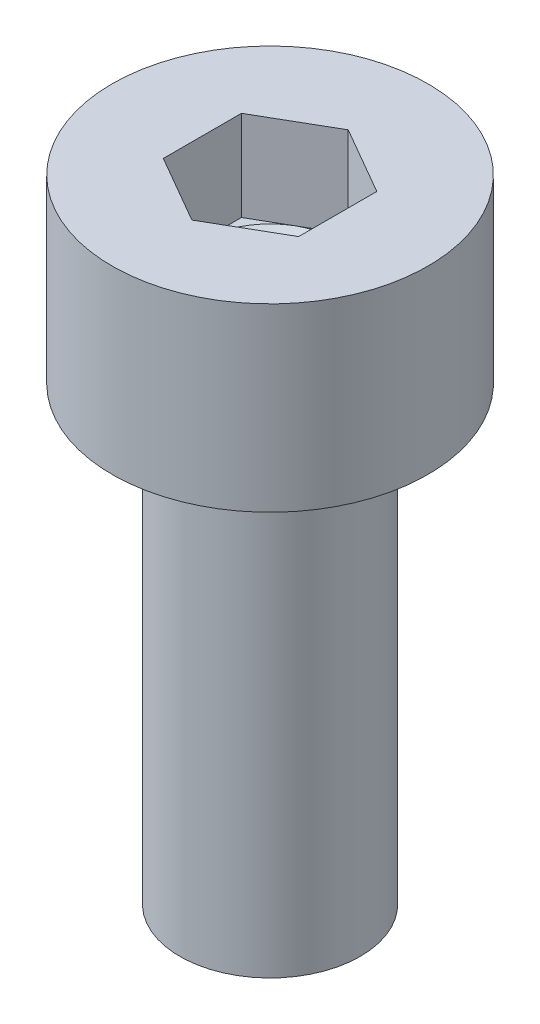
ISO-10303-21;
HEADER;
FILE_DESCRIPTION(('STEP AP214'),'2;1');
FILE_NAME('part.step','',(''),(''),'','','');
FILE_SCHEMA(('AUTOMOTIVE_DESIGN { 1 0 10303 214 1 1 1 1 }'));
ENDSEC;
DATA;
#1=APPLICATION_CONTEXT('core data for automotive mechanical design processes');
#2=APPLICATION_PROTOCOL_DEFINITION('international standard','automotive_design',2000,#1);
#3=PRODUCT_CONTEXT('',#1,'mechanical');
#4=PRODUCT('Part','Part','',(#3));
#5=PRODUCT_RELATED_PRODUCT_CATEGORY('part','',(#4));
#6=PRODUCT_DEFINITION_FORMATION('','',#4);
#7=PRODUCT_DEFINITION_CONTEXT('part definition',#1,'design');
#8=PRODUCT_DEFINITION('design','',#6,#7);
#9=PRODUCT_DEFINITION_SHAPE('','',#8);
#10=(LENGTH_UNIT() NAMED_UNIT(*) SI_UNIT(.MILLI.,.METRE.));
#11=(NAMED_UNIT(*) PLANE_ANGLE_UNIT() SI_UNIT($,.RADIAN.));
#12=(NAMED_UNIT(*) SI_UNIT($,.STERADIAN.) SOLID_ANGLE_UNIT());
#13=UNCERTAINTY_MEASURE_WITH_UNIT(LENGTH_MEASURE(1.E-05),#10,'distance_accuracy_value','');
#14=(GEOMETRIC_REPRESENTATION_CONTEXT(3) GLOBAL_UNCERTAINTY_ASSIGNED_CONTEXT((#13)) GLOBAL_UNIT_ASSIGNED_CONTEXT((#10,
#11,#12)) REPRESENTATION_CONTEXT('',''));
#15=CARTESIAN_POINT('',(0.,0.,0.));
#16=DIRECTION('',(0.,0.,1.));
#17=DIRECTION('',(1.,0.,0.));
#18=AXIS2_PLACEMENT_3D('',#15,#16,#17);
#19=CARTESIAN_POINT('',(0.,0.,0.));
#20=DIRECTION('',(0.,-1.,0.));
#21=DIRECTION('',(1.,0.,0.));
#22=AXIS2_PLACEMENT_3D('',#19,#20,#21);
#23=PLANE('',#22);
#24=CARTESIAN_POINT('',(0.,0.,0.));
#25=DIRECTION('',(0.,1.,0.));
#26=DIRECTION('',(-1.,0.,0.));
#27=AXIS2_PLACEMENT_3D('',#24,#25,#26);
#28=CIRCLE('',#27,3.5);
#29=CARTESIAN_POINT('',(-3.5,0.,0.));
#30=VERTEX_POINT('',#29);
#31=EDGE_CURVE('E11',#30,#30,#28,.T.);
#32=ORIENTED_EDGE('',*,*,#31,.T.);
#33=EDGE_LOOP('',(#32));
#34=FACE_BOUND('',#33,.T.);
#35=DIRECTION('',(-0.866025403784439,0.,0.5));
#36=VECTOR('',#35,1.);
#37=CARTESIAN_POINT('',(0.,0.,-1.73205080756888));
#38=LINE('',#37,#36);
#39=CARTESIAN_POINT('',(0.,0.,-1.73205080756888));
#40=VERTEX_POINT('',#39);
#41=CARTESIAN_POINT('',(-1.5,0.,-0.866025403784439));
#42=VERTEX_POINT('',#41);
#43=EDGE_CURVE('E152',#40,#42,#38,.T.);
#44=ORIENTED_EDGE('',*,*,#43,.F.);
#45=DIRECTION('',(-0.866025403784439,0.,-0.5));
#46=VECTOR('',#45,1.);
#47=CARTESIAN_POINT('',(1.5,0.,-0.866025403784439));
#48=LINE('',#47,#46);
#49=CARTESIAN_POINT('',(1.5,0.,-0.866025403784439));
#50=VERTEX_POINT('',#49);
#51=EDGE_CURVE('E53',#50,#40,#48,.T.);
#52=ORIENTED_EDGE('',*,*,#51,.F.);
#53=DIRECTION('',(0.,0.,-1.));
#54=VECTOR('',#53,1.);
#55=CARTESIAN_POINT('',(1.5,0.,0.866025403784439));
#56=LINE('',#55,#54);
#57=CARTESIAN_POINT('',(1.5,0.,0.866025403784439));
#58=VERTEX_POINT('',#57);
#59=EDGE_CURVE('E123',#58,#50,#56,.T.);
#60=ORIENTED_EDGE('',*,*,#59,.F.);
#61=DIRECTION('',(0.866025403784439,0.,-0.5));
#62=VECTOR('',#61,1.);
#63=CARTESIAN_POINT('',(0.,0.,1.73205080756888));
#64=LINE('',#63,#62);
#65=CARTESIAN_POINT('',(0.,0.,1.73205080756888));
#66=VERTEX_POINT('',#65);
#67=EDGE_CURVE('E159',#66,#58,#64,.T.);
#68=ORIENTED_EDGE('',*,*,#67,.F.);
#69=DIRECTION('',(0.866025403784439,0.,0.5));
#70=VECTOR('',#69,1.);
#71=CARTESIAN_POINT('',(-1.5,0.,0.866025403784439));
#72=LINE('',#71,#70);
#73=CARTESIAN_POINT('',(-1.5,0.,0.866025403784439));
#74=VERTEX_POINT('',#73);
#75=EDGE_CURVE('E156',#74,#66,#72,.T.);
#76=ORIENTED_EDGE('',*,*,#75,.F.);
#77=DIRECTION('',(0.,0.,1.));
#78=VECTOR('',#77,1.);
#79=CARTESIAN_POINT('',(-1.5,0.,-0.866025403784439));
#80=LINE('',#79,#78);
#81=EDGE_CURVE('E154',#42,#74,#80,.T.);
#82=ORIENTED_EDGE('',*,*,#81,.F.);
#83=EDGE_LOOP('',(#44,#52,#60,#68,#76,#82));
#84=FACE_BOUND('',#83,.T.);
#85=ADVANCED_FACE('F39',(#34,#84),#23,.F.);
#86=CARTESIAN_POINT('',(0.,0.,0.));
#87=DIRECTION('',(0.,1.,0.));
#88=DIRECTION('',(-1.,0.,0.));
#89=AXIS2_PLACEMENT_3D('',#86,#87,#88);
#90=CYLINDRICAL_SURFACE('',#89,3.5);
#91=ORIENTED_EDGE('',*,*,#31,.F.);
#92=EDGE_LOOP('',(#91));
#93=FACE_BOUND('',#92,.T.);
#94=CARTESIAN_POINT('',(0.,-4.,0.));
#95=DIRECTION('',(0.,1.,0.));
#96=DIRECTION('',(-1.,0.,0.));
#97=AXIS2_PLACEMENT_3D('',#94,#95,#96);
#98=CIRCLE('',#97,3.5);
#99=CARTESIAN_POINT('',(-3.5,-4.,0.));
#100=VERTEX_POINT('',#99);
#101=EDGE_CURVE('E46',#100,#100,#98,.T.);
#102=ORIENTED_EDGE('',*,*,#101,.T.);
#103=EDGE_LOOP('',(#102));
#104=FACE_BOUND('',#103,.T.);
#105=ADVANCED_FACE('F188',(#93,#104),#90,.T.);
#106=CARTESIAN_POINT('',(3.5,-4.,0.));
#107=DIRECTION('',(0.,1.,0.));
#108=DIRECTION('',(-1.,0.,0.));
#109=AXIS2_PLACEMENT_3D('',#106,#107,#108);
#110=PLANE('',#109);
#111=ORIENTED_EDGE('',*,*,#101,.F.);
#112=EDGE_LOOP('',(#111));
#113=FACE_BOUND('',#112,.T.);
#114=CARTESIAN_POINT('',(0.,-4.,0.));
#115=DIRECTION('',(0.,1.,0.));
#116=DIRECTION('',(-1.,0.,0.));
#117=AXIS2_PLACEMENT_3D('',#114,#115,#116);
#118=CIRCLE('',#117,2.);
#119=CARTESIAN_POINT('',(-2.,-4.,0.));
#120=VERTEX_POINT('',#119);
#121=EDGE_CURVE('E183',#120,#120,#118,.T.);
#122=ORIENTED_EDGE('',*,*,#121,.T.);
#123=EDGE_LOOP('',(#122));
#124=FACE_BOUND('',#123,.T.);
#125=ADVANCED_FACE('F190',(#113,#124),#110,.F.);
#126=CARTESIAN_POINT('',(0.,0.,0.));
#127=DIRECTION('',(0.,1.,0.));
#128=DIRECTION('',(-1.,0.,0.));
#129=AXIS2_PLACEMENT_3D('',#126,#127,#128);
#130=CYLINDRICAL_SURFACE('',#129,2.);
#131=ORIENTED_EDGE('',*,*,#121,.F.);
#132=EDGE_LOOP('',(#131));
#133=FACE_BOUND('',#132,.T.);
#134=CARTESIAN_POINT('',(0.,-14.,0.));
#135=DIRECTION('',(0.,1.,0.));
#136=DIRECTION('',(-1.,0.,0.));
#137=AXIS2_PLACEMENT_3D('',#134,#135,#136);
#138=CIRCLE('',#137,2.);
#139=CARTESIAN_POINT('',(-2.,-14.,0.));
#140=VERTEX_POINT('',#139);
#141=EDGE_CURVE('E179',#140,#140,#138,.T.);
#142=ORIENTED_EDGE('',*,*,#141,.T.);
#143=EDGE_LOOP('',(#142));
#144=FACE_BOUND('',#143,.T.);
#145=ADVANCED_FACE('F193',(#133,#144),#130,.T.);
#146=CARTESIAN_POINT('',(2.,-14.,0.));
#147=DIRECTION('',(0.,1.,0.));
#148=DIRECTION('',(-1.,0.,0.));
#149=AXIS2_PLACEMENT_3D('',#146,#147,#148);
#150=PLANE('',#149);
#151=ORIENTED_EDGE('',*,*,#141,.F.);
#152=EDGE_LOOP('',(#151));
#153=FACE_BOUND('',#152,.T.);
#154=ADVANCED_FACE('F199',(#153),#150,.F.);
#155=CARTESIAN_POINT('',(1.5,-2.00000000000004,-0.866025403784439));
#156=DIRECTION('',(0.5,0.,-0.866025403784439));
#157=DIRECTION('',(-0.866025403784439,0.,-0.5));
#158=AXIS2_PLACEMENT_3D('',#155,#156,#157);
#159=PLANE('',#158);
#160=DIRECTION('',(-0.866025403784439,0.,-0.5));
#161=VECTOR('',#160,1.);
#162=CARTESIAN_POINT('',(1.5,-2.00000000000004,-0.866025403784439));
#163=LINE('',#162,#161);
#164=CARTESIAN_POINT('',(1.5,-2.00000000000004,-0.866025403784439));
#165=VERTEX_POINT('',#164);
#166=CARTESIAN_POINT('',(0.75,-2.00000000000004,-1.29903810567666));
#167=VERTEX_POINT('',#166);
#168=EDGE_CURVE('E122',#165,#167,#163,.T.);
#169=ORIENTED_EDGE('',*,*,#168,.F.);
#170=DIRECTION('',(0.,1.,0.));
#171=VECTOR('',#170,1.);
#172=CARTESIAN_POINT('',(1.5,-2.00000000000004,-0.866025403784439));
#173=LINE('',#172,#171);
#174=EDGE_CURVE('E162',#165,#50,#173,.T.);
#175=ORIENTED_EDGE('',*,*,#174,.T.);
#176=ORIENTED_EDGE('',*,*,#51,.T.);
#177=DIRECTION('',(0.,1.,0.));
#178=VECTOR('',#177,1.);
#179=CARTESIAN_POINT('',(0.,-2.00000000000004,-1.73205080756888));
#180=LINE('',#179,#178);
#181=CARTESIAN_POINT('',(0.,-2.00000000000004,-1.73205080756888));
#182=VERTEX_POINT('',#181);
#183=EDGE_CURVE('E125',#182,#40,#180,.T.);
#184=ORIENTED_EDGE('',*,*,#183,.F.);
#185=EDGE_CURVE('E114',#167,#182,#163,.T.);
#186=ORIENTED_EDGE('',*,*,#185,.F.);
#187=EDGE_LOOP('',(#169,#175,#176,#184,#186));
#188=FACE_BOUND('',#187,.T.);
#189=ADVANCED_FACE('F126',(#188),#159,.F.);
#190=CARTESIAN_POINT('',(1.5,-2.00000000000004,0.866025403784439));
#191=DIRECTION('',(1.,0.,0.));
#192=DIRECTION('',(0.,0.,-1.));
#193=AXIS2_PLACEMENT_3D('',#190,#191,#192);
#194=PLANE('',#193);
#195=DIRECTION('',(0.,0.,-1.));
#196=VECTOR('',#195,1.);
#197=CARTESIAN_POINT('',(1.5,-2.00000000000004,0.866025403784439));
#198=LINE('',#197,#196);
#199=CARTESIAN_POINT('',(1.5,-2.00000000000004,0.866025403784439));
#200=VERTEX_POINT('',#199);
#201=CARTESIAN_POINT('',(1.5,-2.00000000000004,0.));
#202=VERTEX_POINT('',#201);
#203=EDGE_CURVE('E130',#200,#202,#198,.T.);
#204=ORIENTED_EDGE('',*,*,#203,.F.);
#205=DIRECTION('',(0.,1.,0.));
#206=VECTOR('',#205,1.);
#207=CARTESIAN_POINT('',(1.5,-2.00000000000004,0.866025403784439));
#208=LINE('',#207,#206);
#209=EDGE_CURVE('E165',#200,#58,#208,.T.);
#210=ORIENTED_EDGE('',*,*,#209,.T.);
#211=ORIENTED_EDGE('',*,*,#59,.T.);
#212=ORIENTED_EDGE('',*,*,#174,.F.);
#213=EDGE_CURVE('E148',#202,#165,#198,.T.);
#214=ORIENTED_EDGE('',*,*,#213,.F.);
#215=EDGE_LOOP('',(#204,#210,#211,#212,#214));
#216=FACE_BOUND('',#215,.T.);
#217=ADVANCED_FACE('F208',(#216),#194,.F.);
#218=CARTESIAN_POINT('',(0.,-2.00000000000004,1.73205080756888));
#219=DIRECTION('',(0.5,0.,0.866025403784439));
#220=DIRECTION('',(0.866025403784439,0.,-0.5));
#221=AXIS2_PLACEMENT_3D('',#218,#219,#220);
#222=PLANE('',#221);
#223=DIRECTION('',(0.866025403784439,0.,-0.5));
#224=VECTOR('',#223,1.);
#225=CARTESIAN_POINT('',(0.,-2.00000000000004,1.73205080756888));
#226=LINE('',#225,#224);
#227=CARTESIAN_POINT('',(0.,-2.00000000000004,1.73205080756888));
#228=VERTEX_POINT('',#227);
#229=CARTESIAN_POINT('',(0.75,-2.,1.29903810567666));
#230=VERTEX_POINT('',#229);
#231=EDGE_CURVE('E61',#228,#230,#226,.T.);
#232=ORIENTED_EDGE('',*,*,#231,.F.);
#233=DIRECTION('',(0.,1.,0.));
#234=VECTOR('',#233,1.);
#235=CARTESIAN_POINT('',(0.,-2.00000000000004,1.73205080756888));
#236=LINE('',#235,#234);
#237=EDGE_CURVE('E168',#228,#66,#236,.T.);
#238=ORIENTED_EDGE('',*,*,#237,.T.);
#239=ORIENTED_EDGE('',*,*,#67,.T.);
#240=ORIENTED_EDGE('',*,*,#209,.F.);
#241=EDGE_CURVE('E146',#230,#200,#226,.T.);
#242=ORIENTED_EDGE('',*,*,#241,.F.);
#243=EDGE_LOOP('',(#232,#238,#239,#240,#242));
#244=FACE_BOUND('',#243,.T.);
#245=ADVANCED_FACE('F249',(#244),#222,.F.);
#246=CARTESIAN_POINT('',(-1.5,-2.00000000000004,0.866025403784439));
#247=DIRECTION('',(-0.5,0.,0.866025403784439));
#248=DIRECTION('',(0.866025403784439,0.,0.5));
#249=AXIS2_PLACEMENT_3D('',#246,#247,#248);
#250=PLANE('',#249);
#251=DIRECTION('',(0.866025403784439,0.,0.5));
#252=VECTOR('',#251,1.);
#253=CARTESIAN_POINT('',(-1.5,-2.00000000000004,0.866025403784439));
#254=LINE('',#253,#252);
#255=CARTESIAN_POINT('',(-1.5,-2.00000000000004,0.866025403784439));
#256=VERTEX_POINT('',#255);
#257=CARTESIAN_POINT('',(-0.75,-2.00000000000004,1.29903810567666));
#258=VERTEX_POINT('',#257);
#259=EDGE_CURVE('E143',#256,#258,#254,.T.);
#260=ORIENTED_EDGE('',*,*,#259,.F.);
#261=DIRECTION('',(0.,1.,0.));
#262=VECTOR('',#261,1.);
#263=CARTESIAN_POINT('',(-1.5,-2.00000000000004,0.866025403784439));
#264=LINE('',#263,#262);
#265=EDGE_CURVE('E171',#256,#74,#264,.T.);
#266=ORIENTED_EDGE('',*,*,#265,.T.);
#267=ORIENTED_EDGE('',*,*,#75,.T.);
#268=ORIENTED_EDGE('',*,*,#237,.F.);
#269=EDGE_CURVE('E142',#258,#228,#254,.T.);
#270=ORIENTED_EDGE('',*,*,#269,.F.);
#271=EDGE_LOOP('',(#260,#266,#267,#268,#270));
#272=FACE_BOUND('',#271,.T.);
#273=ADVANCED_FACE('F244',(#272),#250,.F.);
#274=CARTESIAN_POINT('',(-1.5,-2.00000000000004,-0.866025403784439));
#275=DIRECTION('',(-1.,0.,0.));
#276=DIRECTION('',(0.,0.,1.));
#277=AXIS2_PLACEMENT_3D('',#274,#275,#276);
#278=PLANE('',#277);
#279=DIRECTION('',(0.,0.,1.));
#280=VECTOR('',#279,1.);
#281=CARTESIAN_POINT('',(-1.5,-2.00000000000004,-0.866025403784439));
#282=LINE('',#281,#280);
#283=CARTESIAN_POINT('',(-1.5,-2.00000000000004,-0.866025403784439));
#284=VERTEX_POINT('',#283);
#285=CARTESIAN_POINT('',(-1.5,-2.00000000000004,0.));
#286=VERTEX_POINT('',#285);
#287=EDGE_CURVE('E138',#284,#286,#282,.T.);
#288=ORIENTED_EDGE('',*,*,#287,.F.);
#289=DIRECTION('',(0.,1.,0.));
#290=VECTOR('',#289,1.);
#291=CARTESIAN_POINT('',(-1.5,-2.00000000000004,-0.866025403784439));
#292=LINE('',#291,#290);
#293=EDGE_CURVE('E129',#284,#42,#292,.T.);
#294=ORIENTED_EDGE('',*,*,#293,.T.);
#295=ORIENTED_EDGE('',*,*,#81,.T.);
#296=ORIENTED_EDGE('',*,*,#265,.F.);
#297=EDGE_CURVE('E136',#286,#256,#282,.T.);
#298=ORIENTED_EDGE('',*,*,#297,.F.);
#299=EDGE_LOOP('',(#288,#294,#295,#296,#298));
#300=FACE_BOUND('',#299,.T.);
#301=ADVANCED_FACE('F224',(#300),#278,.F.);
#302=CARTESIAN_POINT('',(0.,-2.00000000000004,-1.73205080756888));
#303=DIRECTION('',(-0.5,0.,-0.866025403784439));
#304=DIRECTION('',(-0.866025403784439,0.,0.5));
#305=AXIS2_PLACEMENT_3D('',#302,#303,#304);
#306=PLANE('',#305);
#307=DIRECTION('',(-0.866025403784439,0.,0.5));
#308=VECTOR('',#307,1.);
#309=CARTESIAN_POINT('',(0.,-2.00000000000004,-1.73205080756888));
#310=LINE('',#309,#308);
#311=CARTESIAN_POINT('',(-0.75,-2.00000000000004,-1.29903810567666));
#312=VERTEX_POINT('',#311);
#313=EDGE_CURVE('E117',#182,#312,#310,.T.);
#314=ORIENTED_EDGE('',*,*,#313,.F.);
#315=ORIENTED_EDGE('',*,*,#183,.T.);
#316=ORIENTED_EDGE('',*,*,#43,.T.);
#317=ORIENTED_EDGE('',*,*,#293,.F.);
#318=EDGE_CURVE('E135',#312,#284,#310,.T.);
#319=ORIENTED_EDGE('',*,*,#318,.F.);
#320=EDGE_LOOP('',(#314,#315,#316,#317,#319));
#321=FACE_BOUND('',#320,.T.);
#322=ADVANCED_FACE('F133',(#321),#306,.F.);
#323=CARTESIAN_POINT('',(0.,-2.00000000000004,0.));
#324=DIRECTION('',(0.,1.,0.));
#325=DIRECTION('',(0.,0.,1.));
#326=AXIS2_PLACEMENT_3D('',#323,#324,#325);
#327=PLANE('',#326);
#328=ORIENTED_EDGE('',*,*,#241,.T.);
#329=ORIENTED_EDGE('',*,*,#203,.T.);
#330=CARTESIAN_POINT('',(0.,-2.,0.));
#331=DIRECTION('',(0.,1.,0.));
#332=DIRECTION('',(0.,0.,1.));
#333=AXIS2_PLACEMENT_3D('',#330,#331,#332);
#334=CIRCLE('',#333,1.5);
#335=EDGE_CURVE('E176',#230,#202,#334,.T.);
#336=ORIENTED_EDGE('',*,*,#335,.F.);
#337=EDGE_LOOP('',(#328,#329,#336));
#338=FACE_BOUND('',#337,.T.);
#339=ADVANCED_FACE('F255',(#338),#327,.T.);
#340=ORIENTED_EDGE('',*,*,#213,.T.);
#341=ORIENTED_EDGE('',*,*,#168,.T.);
#342=EDGE_CURVE('E180',#202,#167,#334,.T.);
#343=ORIENTED_EDGE('',*,*,#342,.F.);
#344=EDGE_LOOP('',(#340,#341,#343));
#345=FACE_BOUND('',#344,.T.);
#346=ADVANCED_FACE('F257',(#345),#327,.T.);
#347=ORIENTED_EDGE('',*,*,#185,.T.);
#348=ORIENTED_EDGE('',*,*,#313,.T.);
#349=EDGE_CURVE('E119',#167,#312,#334,.T.);
#350=ORIENTED_EDGE('',*,*,#349,.F.);
#351=EDGE_LOOP('',(#347,#348,#350));
#352=FACE_BOUND('',#351,.T.);
#353=ADVANCED_FACE('F115',(#352),#327,.T.);
#354=ORIENTED_EDGE('',*,*,#318,.T.);
#355=ORIENTED_EDGE('',*,*,#287,.T.);
#356=EDGE_CURVE('E230',#312,#286,#334,.T.);
#357=ORIENTED_EDGE('',*,*,#356,.F.);
#358=EDGE_LOOP('',(#354,#355,#357));
#359=FACE_BOUND('',#358,.T.);
#360=ADVANCED_FACE('F229',(#359),#327,.T.);
#361=ORIENTED_EDGE('',*,*,#297,.T.);
#362=ORIENTED_EDGE('',*,*,#259,.T.);
#363=EDGE_CURVE('E236',#286,#258,#334,.T.);
#364=ORIENTED_EDGE('',*,*,#363,.F.);
#365=EDGE_LOOP('',(#361,#362,#364));
#366=FACE_BOUND('',#365,.T.);
#367=ADVANCED_FACE('F246',(#366),#327,.T.);
#368=ORIENTED_EDGE('',*,*,#269,.T.);
#369=ORIENTED_EDGE('',*,*,#231,.T.);
#370=EDGE_CURVE('E164',#258,#230,#334,.T.);
#371=ORIENTED_EDGE('',*,*,#370,.F.);
#372=EDGE_LOOP('',(#368,#369,#371));
#373=FACE_BOUND('',#372,.T.);
#374=ADVANCED_FACE('F240',(#373),#327,.T.);
#375=CARTESIAN_POINT('',(0.,-2.86602540378446,0.));
#376=DIRECTION('',(0.,1.,0.));
#377=DIRECTION('',(0.,0.,1.));
#378=AXIS2_PLACEMENT_3D('',#375,#376,#377);
#379=CONICAL_SURFACE('',#378,0.,1.04719755119659);
#380=ORIENTED_EDGE('',*,*,#335,.T.);
#381=ORIENTED_EDGE('',*,*,#342,.T.);
#382=ORIENTED_EDGE('',*,*,#349,.T.);
#383=ORIENTED_EDGE('',*,*,#356,.T.);
#384=ORIENTED_EDGE('',*,*,#363,.T.);
#385=ORIENTED_EDGE('',*,*,#370,.T.);
#386=EDGE_LOOP('',(#380,#381,#382,#383,#384,#385));
#387=FACE_BOUND('',#386,.T.);
#388=CARTESIAN_POINT('',(0.,-2.86602540378446,0.));
#389=VERTEX_POINT('',#388);
#390=VERTEX_LOOP('',#389);
#391=FACE_BOUND('',#390,.T.);
#392=ADVANCED_FACE('F233',(#387,#391),#379,.F.);
#393=CLOSED_SHELL('',(#85,#105,#125,#145,#154,#189,#217,#245,#273,#301,#322,#339,#346,#353,#360,
#367,#374,#392));
#394=MANIFOLD_SOLID_BREP('B2',#393);
#395=ADVANCED_BREP_SHAPE_REPRESENTATION('',(#18,#394),#14);
#396=SHAPE_DEFINITION_REPRESENTATION(#9,#395);
ENDSEC;
END-ISO-10303-21;
